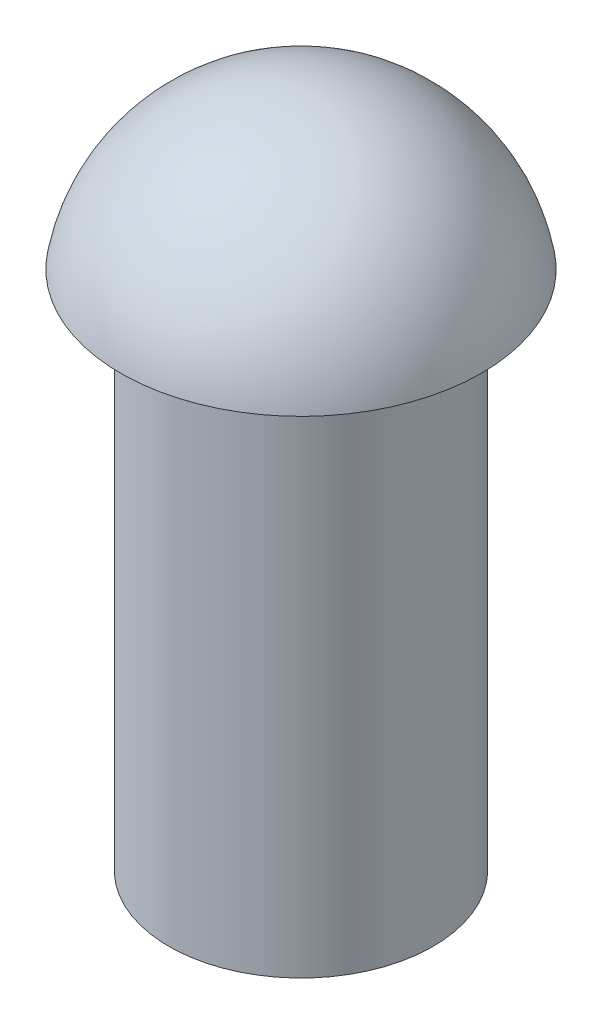
ISO-10303-21;
HEADER;
FILE_DESCRIPTION(('STEP AP214'),'2;1');
FILE_NAME('part.step','',(''),(''),'','','');
FILE_SCHEMA(('AUTOMOTIVE_DESIGN { 1 0 10303 214 1 1 1 1 }'));
ENDSEC;
DATA;
#1=APPLICATION_CONTEXT('core data for automotive mechanical design processes');
#2=APPLICATION_PROTOCOL_DEFINITION('international standard','automotive_design',2000,#1);
#3=PRODUCT_CONTEXT('',#1,'mechanical');
#4=PRODUCT('Part','Part','',(#3));
#5=PRODUCT_RELATED_PRODUCT_CATEGORY('part','',(#4));
#6=PRODUCT_DEFINITION_FORMATION('','',#4);
#7=PRODUCT_DEFINITION_CONTEXT('part definition',#1,'design');
#8=PRODUCT_DEFINITION('design','',#6,#7);
#9=PRODUCT_DEFINITION_SHAPE('','',#8);
#10=(LENGTH_UNIT() NAMED_UNIT(*) SI_UNIT(.MILLI.,.METRE.));
#11=(NAMED_UNIT(*) PLANE_ANGLE_UNIT() SI_UNIT($,.RADIAN.));
#12=(NAMED_UNIT(*) SI_UNIT($,.STERADIAN.) SOLID_ANGLE_UNIT());
#13=UNCERTAINTY_MEASURE_WITH_UNIT(LENGTH_MEASURE(1.E-05),#10,'distance_accuracy_value','');
#14=(GEOMETRIC_REPRESENTATION_CONTEXT(3) GLOBAL_UNCERTAINTY_ASSIGNED_CONTEXT((#13)) GLOBAL_UNIT_ASSIGNED_CONTEXT((#10,
#11,#12)) REPRESENTATION_CONTEXT('',''));
#15=CARTESIAN_POINT('',(0.,0.,0.));
#16=DIRECTION('',(0.,0.,1.));
#17=DIRECTION('',(1.,0.,0.));
#18=AXIS2_PLACEMENT_3D('',#15,#16,#17);
#19=CARTESIAN_POINT('',(0.,11.9854221546111,0.));
#20=DIRECTION('',(0.,-1.,0.));
#21=DIRECTION('',(1.,0.,0.));
#22=AXIS2_PLACEMENT_3D('',#19,#20,#21);
#23=SPHERICAL_SURFACE('',#22,4.47915541060163);
#24=CARTESIAN_POINT('',(0.,12.7396391260924,0.));
#25=DIRECTION('',(0.,-1.,0.));
#26=DIRECTION('',(0.,0.,-1.));
#27=AXIS2_PLACEMENT_3D('',#24,#25,#26);
#28=CIRCLE('',#27,4.41519987681774);
#29=CARTESIAN_POINT('',(0.,12.7396391260924,-4.41519987681774));
#30=VERTEX_POINT('',#29);
#31=EDGE_CURVE('E10',#30,#30,#28,.T.);
#32=ORIENTED_EDGE('',*,*,#31,.F.);
#33=EDGE_LOOP('',(#32));
#34=FACE_BOUND('',#33,.T.);
#35=ADVANCED_FACE('F32',(#34),#23,.T.);
#36=CARTESIAN_POINT('',(3.23106789429878,12.7396391260924,0.));
#37=DIRECTION('',(0.,-1.,0.));
#38=DIRECTION('',(0.,0.,-1.));
#39=AXIS2_PLACEMENT_3D('',#36,#37,#38);
#40=PLANE('',#39);
#41=ORIENTED_EDGE('',*,*,#31,.T.);
#42=EDGE_LOOP('',(#41));
#43=FACE_BOUND('',#42,.T.);
#44=CARTESIAN_POINT('',(0.,12.7396391260924,0.));
#45=DIRECTION('',(0.,-1.,0.));
#46=DIRECTION('',(0.,0.,-1.));
#47=AXIS2_PLACEMENT_3D('',#44,#45,#46);
#48=CIRCLE('',#47,3.23106789429878);
#49=CARTESIAN_POINT('',(0.,12.7396391260924,-3.23106789429878));
#50=VERTEX_POINT('',#49);
#51=EDGE_CURVE('E38',#50,#50,#48,.T.);
#52=ORIENTED_EDGE('',*,*,#51,.F.);
#53=EDGE_LOOP('',(#52));
#54=FACE_BOUND('',#53,.T.);
#55=ADVANCED_FACE('F53',(#43,#54),#40,.T.);
#56=CARTESIAN_POINT('',(0.,0.,0.));
#57=DIRECTION('',(0.,-1.,0.));
#58=DIRECTION('',(0.,0.,-1.));
#59=AXIS2_PLACEMENT_3D('',#56,#57,#58);
#60=CYLINDRICAL_SURFACE('',#59,3.23106789429878);
#61=ORIENTED_EDGE('',*,*,#51,.T.);
#62=EDGE_LOOP('',(#61));
#63=FACE_BOUND('',#62,.T.);
#64=CARTESIAN_POINT('',(0.,0.,0.));
#65=DIRECTION('',(0.,-1.,0.));
#66=DIRECTION('',(0.,0.,-1.));
#67=AXIS2_PLACEMENT_3D('',#64,#65,#66);
#68=CIRCLE('',#67,3.23106789429878);
#69=CARTESIAN_POINT('',(0.,0.,-3.23106789429878));
#70=VERTEX_POINT('',#69);
#71=EDGE_CURVE('E42',#70,#70,#68,.T.);
#72=ORIENTED_EDGE('',*,*,#71,.F.);
#73=EDGE_LOOP('',(#72));
#74=FACE_BOUND('',#73,.T.);
#75=ADVANCED_FACE('F51',(#63,#74),#60,.T.);
#76=CARTESIAN_POINT('',(0.,0.,0.));
#77=DIRECTION('',(0.,-1.,0.));
#78=DIRECTION('',(0.,0.,-1.));
#79=AXIS2_PLACEMENT_3D('',#76,#77,#78);
#80=PLANE('',#79);
#81=ORIENTED_EDGE('',*,*,#71,.T.);
#82=EDGE_LOOP('',(#81));
#83=FACE_BOUND('',#82,.T.);
#84=ADVANCED_FACE('F49',(#83),#80,.T.);
#85=CLOSED_SHELL('',(#35,#55,#75,#84));
#86=MANIFOLD_SOLID_BREP('B2',#85);
#87=ADVANCED_BREP_SHAPE_REPRESENTATION('',(#18,#86),#14);
#88=SHAPE_DEFINITION_REPRESENTATION(#9,#87);
ENDSEC;
END-ISO-10303-21;
